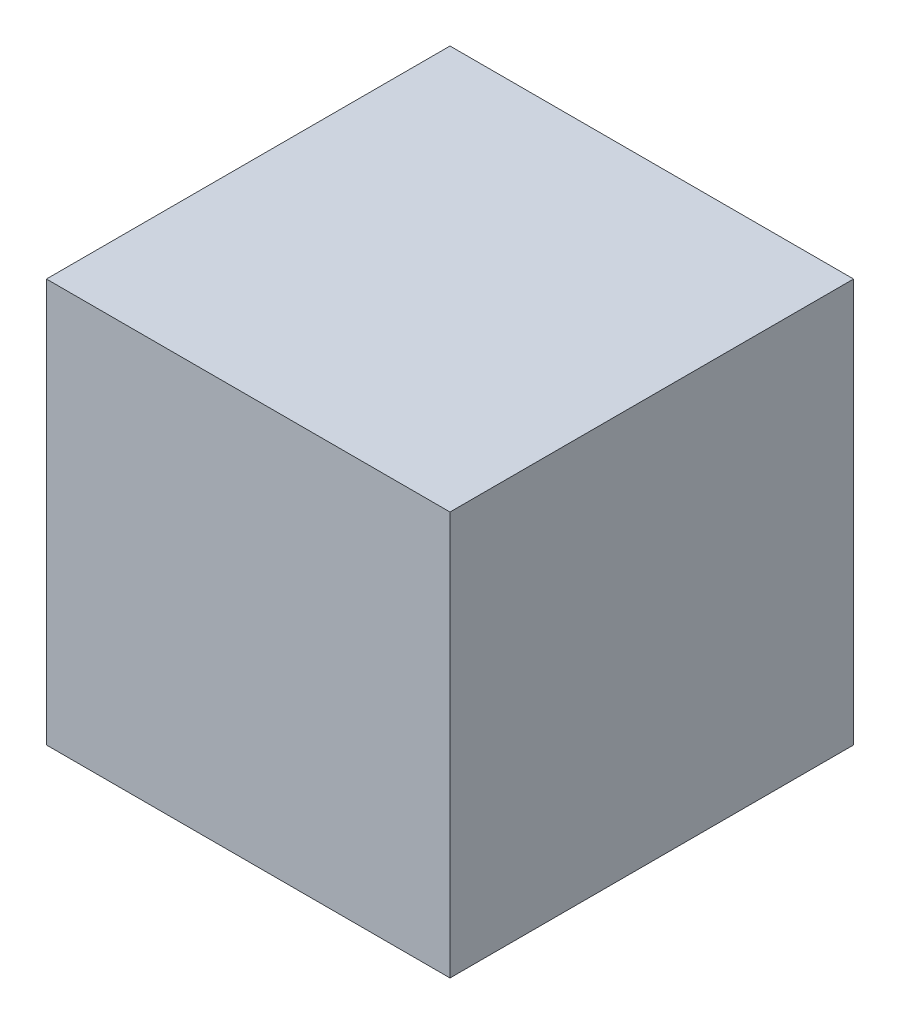
ISO-10303-21;
HEADER;
FILE_DESCRIPTION(('STEP AP214'),'2;1');
FILE_NAME('part.step','',(''),(''),'','','');
FILE_SCHEMA(('AUTOMOTIVE_DESIGN { 1 0 10303 214 1 1 1 1 }'));
ENDSEC;
DATA;
#1=APPLICATION_CONTEXT('core data for automotive mechanical design processes');
#2=APPLICATION_PROTOCOL_DEFINITION('international standard','automotive_design',2000,#1);
#3=PRODUCT_CONTEXT('',#1,'mechanical');
#4=PRODUCT('Part','Part','',(#3));
#5=PRODUCT_RELATED_PRODUCT_CATEGORY('part','',(#4));
#6=PRODUCT_DEFINITION_FORMATION('','',#4);
#7=PRODUCT_DEFINITION_CONTEXT('part definition',#1,'design');
#8=PRODUCT_DEFINITION('design','',#6,#7);
#9=PRODUCT_DEFINITION_SHAPE('','',#8);
#10=(LENGTH_UNIT() NAMED_UNIT(*) SI_UNIT(.MILLI.,.METRE.));
#11=(NAMED_UNIT(*) PLANE_ANGLE_UNIT() SI_UNIT($,.RADIAN.));
#12=(NAMED_UNIT(*) SI_UNIT($,.STERADIAN.) SOLID_ANGLE_UNIT());
#13=UNCERTAINTY_MEASURE_WITH_UNIT(LENGTH_MEASURE(1.E-05),#10,'distance_accuracy_value','');
#14=(GEOMETRIC_REPRESENTATION_CONTEXT(3) GLOBAL_UNCERTAINTY_ASSIGNED_CONTEXT((#13)) GLOBAL_UNIT_ASSIGNED_CONTEXT((#10,
#11,#12)) REPRESENTATION_CONTEXT('',''));
#15=CARTESIAN_POINT('',(0.,0.,0.));
#16=DIRECTION('',(0.,0.,1.));
#17=DIRECTION('',(1.,0.,0.));
#18=AXIS2_PLACEMENT_3D('',#15,#16,#17);
#19=CARTESIAN_POINT('',(50.,-50.,100.));
#20=DIRECTION('',(-1.,0.,0.));
#21=DIRECTION('',(0.,0.,1.));
#22=AXIS2_PLACEMENT_3D('',#19,#20,#21);
#23=PLANE('',#22);
#24=DIRECTION('',(0.,1.,0.));
#25=VECTOR('',#24,1.);
#26=CARTESIAN_POINT('',(50.,-50.,0.));
#27=LINE('',#26,#25);
#28=CARTESIAN_POINT('',(50.,-50.,0.));
#29=VERTEX_POINT('',#28);
#30=CARTESIAN_POINT('',(50.,50.,0.));
#31=VERTEX_POINT('',#30);
#32=EDGE_CURVE('E153',#29,#31,#27,.T.);
#33=ORIENTED_EDGE('',*,*,#32,.T.);
#34=DIRECTION('',(0.,0.,-1.));
#35=VECTOR('',#34,1.);
#36=CARTESIAN_POINT('',(50.,50.,100.));
#37=LINE('',#36,#35);
#38=CARTESIAN_POINT('',(50.,50.,100.));
#39=VERTEX_POINT('',#38);
#40=EDGE_CURVE('E142',#39,#31,#37,.T.);
#41=ORIENTED_EDGE('',*,*,#40,.F.);
#42=DIRECTION('',(0.,1.,0.));
#43=VECTOR('',#42,1.);
#44=CARTESIAN_POINT('',(50.,-50.,100.));
#45=LINE('',#44,#43);
#46=CARTESIAN_POINT('',(50.,-50.,100.));
#47=VERTEX_POINT('',#46);
#48=EDGE_CURVE('E134',#47,#39,#45,.T.);
#49=ORIENTED_EDGE('',*,*,#48,.F.);
#50=DIRECTION('',(0.,0.,-1.));
#51=VECTOR('',#50,1.);
#52=CARTESIAN_POINT('',(50.,-50.,100.));
#53=LINE('',#52,#51);
#54=EDGE_CURVE('E149',#47,#29,#53,.T.);
#55=ORIENTED_EDGE('',*,*,#54,.T.);
#56=EDGE_LOOP('',(#33,#41,#49,#55));
#57=FACE_BOUND('',#56,.T.);
#58=ADVANCED_FACE('F42',(#57),#23,.F.);
#59=CARTESIAN_POINT('',(-50.,50.,100.));
#60=DIRECTION('',(0.,-1.,0.));
#61=DIRECTION('',(0.,0.,-1.));
#62=AXIS2_PLACEMENT_3D('',#59,#60,#61);
#63=PLANE('',#62);
#64=DIRECTION('',(-1.,0.,0.));
#65=VECTOR('',#64,1.);
#66=CARTESIAN_POINT('',(-50.,50.,0.));
#67=LINE('',#66,#65);
#68=CARTESIAN_POINT('',(-50.,50.,0.));
#69=VERTEX_POINT('',#68);
#70=EDGE_CURVE('E140',#31,#69,#67,.T.);
#71=ORIENTED_EDGE('',*,*,#70,.T.);
#72=DIRECTION('',(0.,0.,-1.));
#73=VECTOR('',#72,1.);
#74=CARTESIAN_POINT('',(-50.,50.,100.));
#75=LINE('',#74,#73);
#76=CARTESIAN_POINT('',(-50.,50.,100.));
#77=VERTEX_POINT('',#76);
#78=EDGE_CURVE('E138',#77,#69,#75,.T.);
#79=ORIENTED_EDGE('',*,*,#78,.F.);
#80=DIRECTION('',(-1.,0.,0.));
#81=VECTOR('',#80,1.);
#82=CARTESIAN_POINT('',(-50.,50.,100.));
#83=LINE('',#82,#81);
#84=EDGE_CURVE('E129',#39,#77,#83,.T.);
#85=ORIENTED_EDGE('',*,*,#84,.F.);
#86=ORIENTED_EDGE('',*,*,#40,.T.);
#87=EDGE_LOOP('',(#71,#79,#85,#86));
#88=FACE_BOUND('',#87,.T.);
#89=ADVANCED_FACE('F139',(#88),#63,.F.);
#90=CARTESIAN_POINT('',(-50.,-50.,100.));
#91=DIRECTION('',(1.,0.,0.));
#92=DIRECTION('',(0.,0.,-1.));
#93=AXIS2_PLACEMENT_3D('',#90,#91,#92);
#94=PLANE('',#93);
#95=DIRECTION('',(0.,-1.,0.));
#96=VECTOR('',#95,1.);
#97=CARTESIAN_POINT('',(-50.,-50.,0.));
#98=LINE('',#97,#96);
#99=CARTESIAN_POINT('',(-50.,-50.,0.));
#100=VERTEX_POINT('',#99);
#101=EDGE_CURVE('E115',#69,#100,#98,.T.);
#102=ORIENTED_EDGE('',*,*,#101,.T.);
#103=DIRECTION('',(0.,0.,-1.));
#104=VECTOR('',#103,1.);
#105=CARTESIAN_POINT('',(-50.,-50.,100.));
#106=LINE('',#105,#104);
#107=CARTESIAN_POINT('',(-50.,-50.,100.));
#108=VERTEX_POINT('',#107);
#109=EDGE_CURVE('E143',#108,#100,#106,.T.);
#110=ORIENTED_EDGE('',*,*,#109,.F.);
#111=DIRECTION('',(0.,-1.,0.));
#112=VECTOR('',#111,1.);
#113=CARTESIAN_POINT('',(-50.,-50.,100.));
#114=LINE('',#113,#112);
#115=EDGE_CURVE('E132',#77,#108,#114,.T.);
#116=ORIENTED_EDGE('',*,*,#115,.F.);
#117=ORIENTED_EDGE('',*,*,#78,.T.);
#118=EDGE_LOOP('',(#102,#110,#116,#117));
#119=FACE_BOUND('',#118,.T.);
#120=ADVANCED_FACE('F145',(#119),#94,.F.);
#121=CARTESIAN_POINT('',(-50.,-50.,100.));
#122=DIRECTION('',(0.,1.,0.));
#123=DIRECTION('',(0.,0.,1.));
#124=AXIS2_PLACEMENT_3D('',#121,#122,#123);
#125=PLANE('',#124);
#126=DIRECTION('',(1.,0.,0.));
#127=VECTOR('',#126,1.);
#128=CARTESIAN_POINT('',(-50.,-50.,0.));
#129=LINE('',#128,#127);
#130=EDGE_CURVE('E121',#100,#29,#129,.T.);
#131=ORIENTED_EDGE('',*,*,#130,.T.);
#132=ORIENTED_EDGE('',*,*,#54,.F.);
#133=DIRECTION('',(1.,0.,0.));
#134=VECTOR('',#133,1.);
#135=CARTESIAN_POINT('',(-50.,-50.,100.));
#136=LINE('',#135,#134);
#137=EDGE_CURVE('E98',#108,#47,#136,.T.);
#138=ORIENTED_EDGE('',*,*,#137,.F.);
#139=ORIENTED_EDGE('',*,*,#109,.T.);
#140=EDGE_LOOP('',(#131,#132,#138,#139));
#141=FACE_BOUND('',#140,.T.);
#142=ADVANCED_FACE('F235',(#141),#125,.F.);
#143=CARTESIAN_POINT('',(0.,0.,100.));
#144=DIRECTION('',(0.,0.,-1.));
#145=DIRECTION('',(-1.,0.,0.));
#146=AXIS2_PLACEMENT_3D('',#143,#144,#145);
#147=PLANE('',#146);
#148=ORIENTED_EDGE('',*,*,#48,.T.);
#149=ORIENTED_EDGE('',*,*,#84,.T.);
#150=ORIENTED_EDGE('',*,*,#115,.T.);
#151=ORIENTED_EDGE('',*,*,#137,.T.);
#152=EDGE_LOOP('',(#148,#149,#150,#151));
#153=FACE_BOUND('',#152,.T.);
#154=ADVANCED_FACE('F130',(#153),#147,.F.);
#155=CARTESIAN_POINT('',(0.,0.,0.));
#156=DIRECTION('',(0.,0.,-1.));
#157=DIRECTION('',(-1.,0.,0.));
#158=AXIS2_PLACEMENT_3D('',#155,#156,#157);
#159=PLANE('',#158);
#160=ORIENTED_EDGE('',*,*,#32,.F.);
#161=ORIENTED_EDGE('',*,*,#130,.F.);
#162=ORIENTED_EDGE('',*,*,#101,.F.);
#163=ORIENTED_EDGE('',*,*,#70,.F.);
#164=EDGE_LOOP('',(#160,#161,#162,#163));
#165=FACE_BOUND('',#164,.T.);
#166=ADVANCED_FACE('F238',(#165),#159,.T.);
#167=CLOSED_SHELL('',(#58,#89,#120,#142,#154,#166));
#168=CARTESIAN_POINT('',(40.,-50.,100.));
#169=DIRECTION('',(-1.,0.,0.));
#170=DIRECTION('',(0.,0.,1.));
#171=AXIS2_PLACEMENT_3D('',#168,#169,#170);
#172=PLANE('',#171);
#173=DIRECTION('',(0.,1.,0.));
#174=VECTOR('',#173,1.);
#175=CARTESIAN_POINT('',(40.,0.,10.));
#176=LINE('',#175,#174);
#177=CARTESIAN_POINT('',(40.,-40.,10.));
#178=VERTEX_POINT('',#177);
#179=CARTESIAN_POINT('',(40.,40.,10.));
#180=VERTEX_POINT('',#179);
#181=EDGE_CURVE('E46',#178,#180,#176,.T.);
#182=ORIENTED_EDGE('',*,*,#181,.F.);
#183=DIRECTION('',(0.,0.,-1.));
#184=VECTOR('',#183,1.);
#185=CARTESIAN_POINT('',(40.,-40.,100.));
#186=LINE('',#185,#184);
#187=CARTESIAN_POINT('',(40.,-40.,90.));
#188=VERTEX_POINT('',#187);
#189=EDGE_CURVE('E193',#188,#178,#186,.T.);
#190=ORIENTED_EDGE('',*,*,#189,.F.);
#191=DIRECTION('',(0.,1.,0.));
#192=VECTOR('',#191,1.);
#193=CARTESIAN_POINT('',(40.,0.,90.));
#194=LINE('',#193,#192);
#195=CARTESIAN_POINT('',(40.,40.,90.));
#196=VERTEX_POINT('',#195);
#197=EDGE_CURVE('E173',#188,#196,#194,.T.);
#198=ORIENTED_EDGE('',*,*,#197,.T.);
#199=DIRECTION('',(0.,0.,-1.));
#200=VECTOR('',#199,1.);
#201=CARTESIAN_POINT('',(40.,40.,100.));
#202=LINE('',#201,#200);
#203=EDGE_CURVE('E189',#196,#180,#202,.T.);
#204=ORIENTED_EDGE('',*,*,#203,.T.);
#205=EDGE_LOOP('',(#182,#190,#198,#204));
#206=FACE_BOUND('',#205,.T.);
#207=ADVANCED_FACE('F202',(#206),#172,.T.);
#208=CARTESIAN_POINT('',(-50.,40.,100.));
#209=DIRECTION('',(0.,-1.,0.));
#210=DIRECTION('',(0.,0.,-1.));
#211=AXIS2_PLACEMENT_3D('',#208,#209,#210);
#212=PLANE('',#211);
#213=DIRECTION('',(-1.,0.,0.));
#214=VECTOR('',#213,1.);
#215=CARTESIAN_POINT('',(0.,40.,10.));
#216=LINE('',#215,#214);
#217=CARTESIAN_POINT('',(-40.,40.,10.));
#218=VERTEX_POINT('',#217);
#219=EDGE_CURVE('E63',#180,#218,#216,.T.);
#220=ORIENTED_EDGE('',*,*,#219,.F.);
#221=ORIENTED_EDGE('',*,*,#203,.F.);
#222=DIRECTION('',(-1.,0.,0.));
#223=VECTOR('',#222,1.);
#224=CARTESIAN_POINT('',(0.,40.,90.));
#225=LINE('',#224,#223);
#226=CARTESIAN_POINT('',(-40.,40.,90.));
#227=VERTEX_POINT('',#226);
#228=EDGE_CURVE('E86',#196,#227,#225,.T.);
#229=ORIENTED_EDGE('',*,*,#228,.T.);
#230=DIRECTION('',(0.,0.,-1.));
#231=VECTOR('',#230,1.);
#232=CARTESIAN_POINT('',(-40.,40.,100.));
#233=LINE('',#232,#231);
#234=EDGE_CURVE('E183',#227,#218,#233,.T.);
#235=ORIENTED_EDGE('',*,*,#234,.T.);
#236=EDGE_LOOP('',(#220,#221,#229,#235));
#237=FACE_BOUND('',#236,.T.);
#238=ADVANCED_FACE('F203',(#237),#212,.T.);
#239=CARTESIAN_POINT('',(-40.,-50.,100.));
#240=DIRECTION('',(1.,0.,0.));
#241=DIRECTION('',(0.,0.,-1.));
#242=AXIS2_PLACEMENT_3D('',#239,#240,#241);
#243=PLANE('',#242);
#244=DIRECTION('',(0.,-1.,0.));
#245=VECTOR('',#244,1.);
#246=CARTESIAN_POINT('',(-40.,0.,10.));
#247=LINE('',#246,#245);
#248=CARTESIAN_POINT('',(-40.,-40.,10.));
#249=VERTEX_POINT('',#248);
#250=EDGE_CURVE('E186',#218,#249,#247,.T.);
#251=ORIENTED_EDGE('',*,*,#250,.F.);
#252=ORIENTED_EDGE('',*,*,#234,.F.);
#253=DIRECTION('',(0.,-1.,0.));
#254=VECTOR('',#253,1.);
#255=CARTESIAN_POINT('',(-40.,0.,90.));
#256=LINE('',#255,#254);
#257=CARTESIAN_POINT('',(-40.,-40.,90.));
#258=VERTEX_POINT('',#257);
#259=EDGE_CURVE('E54',#227,#258,#256,.T.);
#260=ORIENTED_EDGE('',*,*,#259,.T.);
#261=DIRECTION('',(0.,0.,-1.));
#262=VECTOR('',#261,1.);
#263=CARTESIAN_POINT('',(-40.,-40.,100.));
#264=LINE('',#263,#262);
#265=EDGE_CURVE('E176',#258,#249,#264,.T.);
#266=ORIENTED_EDGE('',*,*,#265,.T.);
#267=EDGE_LOOP('',(#251,#252,#260,#266));
#268=FACE_BOUND('',#267,.T.);
#269=ADVANCED_FACE('F207',(#268),#243,.T.);
#270=CARTESIAN_POINT('',(-50.,-40.,100.));
#271=DIRECTION('',(0.,1.,0.));
#272=DIRECTION('',(0.,0.,1.));
#273=AXIS2_PLACEMENT_3D('',#270,#271,#272);
#274=PLANE('',#273);
#275=DIRECTION('',(1.,0.,0.));
#276=VECTOR('',#275,1.);
#277=CARTESIAN_POINT('',(0.,-40.,10.));
#278=LINE('',#277,#276);
#279=EDGE_CURVE('E180',#249,#178,#278,.T.);
#280=ORIENTED_EDGE('',*,*,#279,.F.);
#281=ORIENTED_EDGE('',*,*,#265,.F.);
#282=DIRECTION('',(1.,0.,0.));
#283=VECTOR('',#282,1.);
#284=CARTESIAN_POINT('',(0.,-40.,90.));
#285=LINE('',#284,#283);
#286=EDGE_CURVE('E11',#258,#188,#285,.T.);
#287=ORIENTED_EDGE('',*,*,#286,.T.);
#288=ORIENTED_EDGE('',*,*,#189,.T.);
#289=EDGE_LOOP('',(#280,#281,#287,#288));
#290=FACE_BOUND('',#289,.T.);
#291=ADVANCED_FACE('F211',(#290),#274,.T.);
#292=CARTESIAN_POINT('',(0.,0.,90.));
#293=DIRECTION('',(0.,0.,-1.));
#294=DIRECTION('',(-1.,0.,0.));
#295=AXIS2_PLACEMENT_3D('',#292,#293,#294);
#296=PLANE('',#295);
#297=ORIENTED_EDGE('',*,*,#197,.F.);
#298=ORIENTED_EDGE('',*,*,#286,.F.);
#299=ORIENTED_EDGE('',*,*,#259,.F.);
#300=ORIENTED_EDGE('',*,*,#228,.F.);
#301=EDGE_LOOP('',(#297,#298,#299,#300));
#302=FACE_BOUND('',#301,.T.);
#303=ADVANCED_FACE('F210',(#302),#296,.T.);
#304=CARTESIAN_POINT('',(0.,0.,10.));
#305=DIRECTION('',(0.,0.,-1.));
#306=DIRECTION('',(-1.,0.,0.));
#307=AXIS2_PLACEMENT_3D('',#304,#305,#306);
#308=PLANE('',#307);
#309=ORIENTED_EDGE('',*,*,#181,.T.);
#310=ORIENTED_EDGE('',*,*,#219,.T.);
#311=ORIENTED_EDGE('',*,*,#250,.T.);
#312=ORIENTED_EDGE('',*,*,#279,.T.);
#313=EDGE_LOOP('',(#309,#310,#311,#312));
#314=FACE_BOUND('',#313,.T.);
#315=ADVANCED_FACE('F44',(#314),#308,.F.);
#316=CLOSED_SHELL('',(#207,#238,#269,#291,#303,#315));
#317=ORIENTED_CLOSED_SHELL('',*,#316,.T.);
#318=BREP_WITH_VOIDS('B2',#167,(#317));
#319=ADVANCED_BREP_SHAPE_REPRESENTATION('',(#18,#318),#14);
#320=SHAPE_DEFINITION_REPRESENTATION(#9,#319);
ENDSEC;
END-ISO-10303-21;
